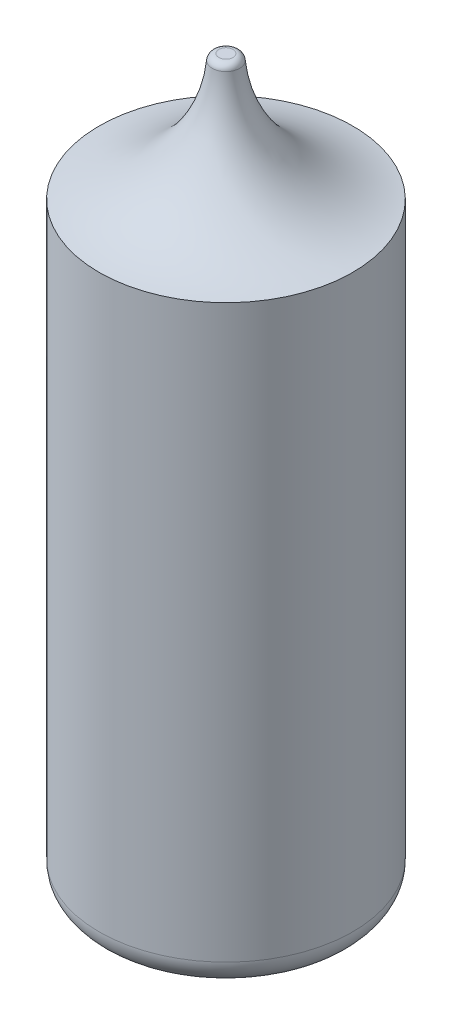
ISO-10303-21;
HEADER;
FILE_DESCRIPTION(('STEP AP214'),'2;1');
FILE_NAME('part.step','',(''),(''),'','','');
FILE_SCHEMA(('AUTOMOTIVE_DESIGN { 1 0 10303 214 1 1 1 1 }'));
ENDSEC;
DATA;
#1=APPLICATION_CONTEXT('core data for automotive mechanical design processes');
#2=APPLICATION_PROTOCOL_DEFINITION('international standard','automotive_design',2000,#1);
#3=PRODUCT_CONTEXT('',#1,'mechanical');
#4=PRODUCT('Part','Part','',(#3));
#5=PRODUCT_RELATED_PRODUCT_CATEGORY('part','',(#4));
#6=PRODUCT_DEFINITION_FORMATION('','',#4);
#7=PRODUCT_DEFINITION_CONTEXT('part definition',#1,'design');
#8=PRODUCT_DEFINITION('design','',#6,#7);
#9=PRODUCT_DEFINITION_SHAPE('','',#8);
#10=(LENGTH_UNIT() NAMED_UNIT(*) SI_UNIT(.MILLI.,.METRE.));
#11=(NAMED_UNIT(*) PLANE_ANGLE_UNIT() SI_UNIT($,.RADIAN.));
#12=(NAMED_UNIT(*) SI_UNIT($,.STERADIAN.) SOLID_ANGLE_UNIT());
#13=UNCERTAINTY_MEASURE_WITH_UNIT(LENGTH_MEASURE(1.E-05),#10,'distance_accuracy_value','');
#14=(GEOMETRIC_REPRESENTATION_CONTEXT(3) GLOBAL_UNCERTAINTY_ASSIGNED_CONTEXT((#13)) GLOBAL_UNIT_ASSIGNED_CONTEXT((#10,
#11,#12)) REPRESENTATION_CONTEXT('',''));
#15=CARTESIAN_POINT('',(0.,0.,0.));
#16=DIRECTION('',(0.,0.,1.));
#17=DIRECTION('',(1.,0.,0.));
#18=AXIS2_PLACEMENT_3D('',#15,#16,#17);
#19=CARTESIAN_POINT('',(0.,0.,0.));
#20=DIRECTION('',(0.,1.,0.));
#21=DIRECTION('',(0.,0.,1.));
#22=AXIS2_PLACEMENT_3D('',#19,#20,#21);
#23=PLANE('',#22);
#24=CARTESIAN_POINT('',(0.,0.,0.));
#25=DIRECTION('',(0.,1.,0.));
#26=DIRECTION('',(0.,0.,1.));
#27=AXIS2_PLACEMENT_3D('',#24,#25,#26);
#28=CIRCLE('',#27,7.54999999999999);
#29=CARTESIAN_POINT('',(0.,0.,7.54999999999999));
#30=VERTEX_POINT('',#29);
#31=EDGE_CURVE('E10',#30,#30,#28,.T.);
#32=ORIENTED_EDGE('',*,*,#31,.F.);
#33=EDGE_LOOP('',(#32));
#34=FACE_BOUND('',#33,.T.);
#35=ADVANCED_FACE('F37',(#34),#23,.F.);
#36=CARTESIAN_POINT('',(0.,2.,0.));
#37=DIRECTION('',(0.,1.,0.));
#38=DIRECTION('',(0.,0.,1.));
#39=AXIS2_PLACEMENT_3D('',#36,#37,#38);
#40=TOROIDAL_SURFACE('',#39,7.55,2.);
#41=CARTESIAN_POINT('',(0.,2.,0.));
#42=DIRECTION('',(0.,1.,0.));
#43=DIRECTION('',(0.,0.,1.));
#44=AXIS2_PLACEMENT_3D('',#41,#42,#43);
#45=CIRCLE('',#44,9.55);
#46=CARTESIAN_POINT('',(0.,2.,9.55));
#47=VERTEX_POINT('',#46);
#48=EDGE_CURVE('E44',#47,#47,#45,.T.);
#49=ORIENTED_EDGE('',*,*,#48,.F.);
#50=EDGE_LOOP('',(#49));
#51=FACE_BOUND('',#50,.T.);
#52=ORIENTED_EDGE('',*,*,#31,.T.);
#53=EDGE_LOOP('',(#52));
#54=FACE_BOUND('',#53,.T.);
#55=ADVANCED_FACE('F81',(#51,#54),#40,.T.);
#56=CARTESIAN_POINT('',(0.,54.5,0.));
#57=DIRECTION('',(0.,1.,0.));
#58=DIRECTION('',(0.,0.,1.));
#59=AXIS2_PLACEMENT_3D('',#56,#57,#58);
#60=CYLINDRICAL_SURFACE('',#59,9.55);
#61=CARTESIAN_POINT('',(0.,45.,0.));
#62=DIRECTION('',(0.,1.,0.));
#63=DIRECTION('',(0.,0.,1.));
#64=AXIS2_PLACEMENT_3D('',#61,#62,#63);
#65=CIRCLE('',#64,9.55);
#66=CARTESIAN_POINT('',(0.,45.,9.55));
#67=VERTEX_POINT('',#66);
#68=EDGE_CURVE('E49',#67,#67,#65,.T.);
#69=ORIENTED_EDGE('',*,*,#68,.F.);
#70=EDGE_LOOP('',(#69));
#71=FACE_BOUND('',#70,.T.);
#72=ORIENTED_EDGE('',*,*,#48,.T.);
#73=EDGE_LOOP('',(#72));
#74=FACE_BOUND('',#73,.T.);
#75=ADVANCED_FACE('F76',(#71,#74),#60,.T.);
#76=CARTESIAN_POINT('',(0.,54.8954597671607,0.));
#77=DIRECTION('',(0.,1.,0.));
#78=DIRECTION('',(0.,0.,1.));
#79=AXIS2_PLACEMENT_3D('',#76,#77,#78);
#80=TOROIDAL_SURFACE('',#79,10.9921775190675,10.);
#81=CARTESIAN_POINT('',(0.,54.0426409412934,0.));
#82=DIRECTION('',(0.,1.,0.));
#83=DIRECTION('',(0.,0.,1.));
#84=AXIS2_PLACEMENT_3D('',#81,#82,#83);
#85=CIRCLE('',#84,1.02860887875358);
#86=CARTESIAN_POINT('',(0.,54.0426409412934,1.02860887875358));
#87=VERTEX_POINT('',#86);
#88=EDGE_CURVE('E54',#87,#87,#85,.T.);
#89=ORIENTED_EDGE('',*,*,#88,.F.);
#90=EDGE_LOOP('',(#89));
#91=FACE_BOUND('',#90,.T.);
#92=ORIENTED_EDGE('',*,*,#68,.T.);
#93=EDGE_LOOP('',(#92));
#94=FACE_BOUND('',#93,.T.);
#95=ADVANCED_FACE('F70',(#91,#94),#80,.F.);
#96=CARTESIAN_POINT('',(0.,54.,0.));
#97=DIRECTION('',(0.,1.,0.));
#98=DIRECTION('',(0.,0.,1.));
#99=AXIS2_PLACEMENT_3D('',#96,#97,#98);
#100=TOROIDAL_SURFACE('',#99,0.530430446737884,0.500000000000002);
#101=CARTESIAN_POINT('',(0.,54.5,0.));
#102=DIRECTION('',(0.,1.,0.));
#103=DIRECTION('',(0.,0.,1.));
#104=AXIS2_PLACEMENT_3D('',#101,#102,#103);
#105=CIRCLE('',#104,0.530430446737884);
#106=CARTESIAN_POINT('',(0.,54.5,0.530430446737884));
#107=VERTEX_POINT('',#106);
#108=EDGE_CURVE('E60',#107,#107,#105,.T.);
#109=ORIENTED_EDGE('',*,*,#108,.F.);
#110=EDGE_LOOP('',(#109));
#111=FACE_BOUND('',#110,.T.);
#112=ORIENTED_EDGE('',*,*,#88,.T.);
#113=EDGE_LOOP('',(#112));
#114=FACE_BOUND('',#113,.T.);
#115=ADVANCED_FACE('F67',(#111,#114),#100,.T.);
#116=CARTESIAN_POINT('',(0.,54.5,0.));
#117=DIRECTION('',(0.,-1.,0.));
#118=DIRECTION('',(0.,0.,-1.));
#119=AXIS2_PLACEMENT_3D('',#116,#117,#118);
#120=PLANE('',#119);
#121=ORIENTED_EDGE('',*,*,#108,.T.);
#122=EDGE_LOOP('',(#121));
#123=FACE_BOUND('',#122,.T.);
#124=ADVANCED_FACE('F65',(#123),#120,.F.);
#125=CLOSED_SHELL('',(#35,#55,#75,#95,#115,#124));
#126=MANIFOLD_SOLID_BREP('B2',#125);
#127=ADVANCED_BREP_SHAPE_REPRESENTATION('',(#18,#126),#14);
#128=SHAPE_DEFINITION_REPRESENTATION(#9,#127);
ENDSEC;
END-ISO-10303-21;
